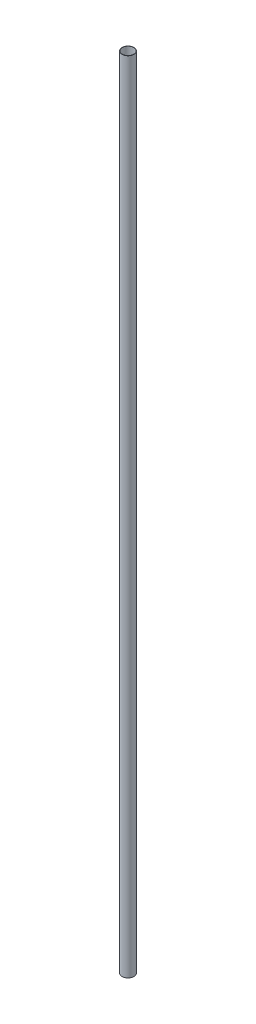
ISO-10303-21;
HEADER;
FILE_DESCRIPTION(('STEP AP214'),'2;1');
FILE_NAME('part.step','',(''),(''),'','','');
FILE_SCHEMA(('AUTOMOTIVE_DESIGN { 1 0 10303 214 1 1 1 1 }'));
ENDSEC;
DATA;
#1=APPLICATION_CONTEXT('core data for automotive mechanical design processes');
#2=APPLICATION_PROTOCOL_DEFINITION('international standard','automotive_design',2000,#1);
#3=PRODUCT_CONTEXT('',#1,'mechanical');
#4=PRODUCT('Part','Part','',(#3));
#5=PRODUCT_RELATED_PRODUCT_CATEGORY('part','',(#4));
#6=PRODUCT_DEFINITION_FORMATION('','',#4);
#7=PRODUCT_DEFINITION_CONTEXT('part definition',#1,'design');
#8=PRODUCT_DEFINITION('design','',#6,#7);
#9=PRODUCT_DEFINITION_SHAPE('','',#8);
#10=(LENGTH_UNIT() NAMED_UNIT(*) SI_UNIT(.MILLI.,.METRE.));
#11=(NAMED_UNIT(*) PLANE_ANGLE_UNIT() SI_UNIT($,.RADIAN.));
#12=(NAMED_UNIT(*) SI_UNIT($,.STERADIAN.) SOLID_ANGLE_UNIT());
#13=UNCERTAINTY_MEASURE_WITH_UNIT(LENGTH_MEASURE(1.E-05),#10,'distance_accuracy_value','');
#14=(GEOMETRIC_REPRESENTATION_CONTEXT(3) GLOBAL_UNCERTAINTY_ASSIGNED_CONTEXT((#13)) GLOBAL_UNIT_ASSIGNED_CONTEXT((#10,
#11,#12)) REPRESENTATION_CONTEXT('',''));
#15=CARTESIAN_POINT('',(0.,0.,0.));
#16=DIRECTION('',(0.,0.,1.));
#17=DIRECTION('',(1.,0.,0.));
#18=AXIS2_PLACEMENT_3D('',#15,#16,#17);
#19=CARTESIAN_POINT('',(0.,2000.,0.));
#20=DIRECTION('',(0.,1.,0.));
#21=DIRECTION('',(0.,0.,1.));
#22=AXIS2_PLACEMENT_3D('',#19,#20,#21);
#23=PLANE('',#22);
#24=CARTESIAN_POINT('',(0.,2000.,0.));
#25=DIRECTION('',(0.,1.,0.));
#26=DIRECTION('',(0.,0.,1.));
#27=AXIS2_PLACEMENT_3D('',#24,#25,#26);
#28=CIRCLE('',#27,15.);
#29=CARTESIAN_POINT('',(0.,2000.,15.));
#30=VERTEX_POINT('',#29);
#31=EDGE_CURVE('E10',#30,#30,#28,.T.);
#32=ORIENTED_EDGE('',*,*,#31,.T.);
#33=EDGE_LOOP('',(#32));
#34=FACE_BOUND('',#33,.T.);
#35=CARTESIAN_POINT('',(0.,2000.,0.));
#36=DIRECTION('',(0.,1.,0.));
#37=DIRECTION('',(0.,0.,1.));
#38=AXIS2_PLACEMENT_3D('',#35,#36,#37);
#39=CIRCLE('',#38,14.4349683137299);
#40=CARTESIAN_POINT('',(0.,2000.,14.4349683137299));
#41=VERTEX_POINT('',#40);
#42=EDGE_CURVE('E48',#41,#41,#39,.T.);
#43=ORIENTED_EDGE('',*,*,#42,.F.);
#44=EDGE_LOOP('',(#43));
#45=FACE_BOUND('',#44,.T.);
#46=ADVANCED_FACE('F37',(#34,#45),#23,.T.);
#47=CARTESIAN_POINT('',(0.,0.,0.));
#48=DIRECTION('',(0.,1.,0.));
#49=DIRECTION('',(0.,0.,1.));
#50=AXIS2_PLACEMENT_3D('',#47,#48,#49);
#51=PLANE('',#50);
#52=CARTESIAN_POINT('',(0.,0.,0.));
#53=DIRECTION('',(0.,1.,0.));
#54=DIRECTION('',(0.,0.,1.));
#55=AXIS2_PLACEMENT_3D('',#52,#53,#54);
#56=CIRCLE('',#55,15.);
#57=CARTESIAN_POINT('',(0.,0.,15.));
#58=VERTEX_POINT('',#57);
#59=EDGE_CURVE('E41',#58,#58,#56,.T.);
#60=ORIENTED_EDGE('',*,*,#59,.F.);
#61=EDGE_LOOP('',(#60));
#62=FACE_BOUND('',#61,.T.);
#63=CARTESIAN_POINT('',(0.,0.,0.));
#64=DIRECTION('',(0.,1.,0.));
#65=DIRECTION('',(0.,0.,1.));
#66=AXIS2_PLACEMENT_3D('',#63,#64,#65);
#67=CIRCLE('',#66,14.4349683137299);
#68=CARTESIAN_POINT('',(0.,0.,14.4349683137299));
#69=VERTEX_POINT('',#68);
#70=EDGE_CURVE('E50',#69,#69,#67,.T.);
#71=ORIENTED_EDGE('',*,*,#70,.T.);
#72=EDGE_LOOP('',(#71));
#73=FACE_BOUND('',#72,.T.);
#74=ADVANCED_FACE('F60',(#62,#73),#51,.F.);
#75=CARTESIAN_POINT('',(0.,2000.,0.));
#76=DIRECTION('',(0.,-1.,0.));
#77=DIRECTION('',(0.,0.,-1.));
#78=AXIS2_PLACEMENT_3D('',#75,#76,#77);
#79=CYLINDRICAL_SURFACE('',#78,15.);
#80=ORIENTED_EDGE('',*,*,#31,.F.);
#81=EDGE_LOOP('',(#80));
#82=FACE_BOUND('',#81,.T.);
#83=ORIENTED_EDGE('',*,*,#59,.T.);
#84=EDGE_LOOP('',(#83));
#85=FACE_BOUND('',#84,.T.);
#86=ADVANCED_FACE('F39',(#82,#85),#79,.T.);
#87=CARTESIAN_POINT('',(0.,2000.,0.));
#88=DIRECTION('',(0.,-1.,0.));
#89=DIRECTION('',(0.,0.,-1.));
#90=AXIS2_PLACEMENT_3D('',#87,#88,#89);
#91=CYLINDRICAL_SURFACE('',#90,14.4349683137299);
#92=ORIENTED_EDGE('',*,*,#42,.T.);
#93=EDGE_LOOP('',(#92));
#94=FACE_BOUND('',#93,.T.);
#95=ORIENTED_EDGE('',*,*,#70,.F.);
#96=EDGE_LOOP('',(#95));
#97=FACE_BOUND('',#96,.T.);
#98=ADVANCED_FACE('F56',(#94,#97),#91,.F.);
#99=CLOSED_SHELL('',(#46,#74,#86,#98));
#100=MANIFOLD_SOLID_BREP('B2',#99);
#101=ADVANCED_BREP_SHAPE_REPRESENTATION('',(#18,#100),#14);
#102=SHAPE_DEFINITION_REPRESENTATION(#9,#101);
ENDSEC;
END-ISO-10303-21;
